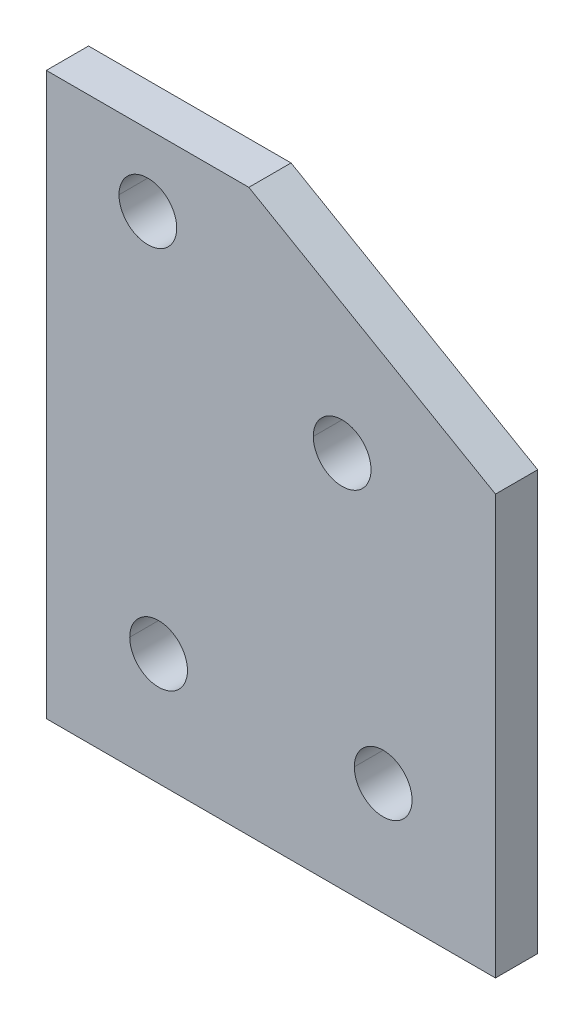
ISO-10303-21;
HEADER;
FILE_DESCRIPTION(('STEP AP214'),'2;1');
FILE_NAME('part.step','',(''),(''),'','','');
FILE_SCHEMA(('AUTOMOTIVE_DESIGN { 1 0 10303 214 1 1 1 1 }'));
ENDSEC;
DATA;
#1=APPLICATION_CONTEXT('core data for automotive mechanical design processes');
#2=APPLICATION_PROTOCOL_DEFINITION('international standard','automotive_design',2000,#1);
#3=PRODUCT_CONTEXT('',#1,'mechanical');
#4=PRODUCT('Part','Part','',(#3));
#5=PRODUCT_RELATED_PRODUCT_CATEGORY('part','',(#4));
#6=PRODUCT_DEFINITION_FORMATION('','',#4);
#7=PRODUCT_DEFINITION_CONTEXT('part definition',#1,'design');
#8=PRODUCT_DEFINITION('design','',#6,#7);
#9=PRODUCT_DEFINITION_SHAPE('','',#8);
#10=(LENGTH_UNIT() NAMED_UNIT(*) SI_UNIT(.MILLI.,.METRE.));
#11=(NAMED_UNIT(*) PLANE_ANGLE_UNIT() SI_UNIT($,.RADIAN.));
#12=(NAMED_UNIT(*) SI_UNIT($,.STERADIAN.) SOLID_ANGLE_UNIT());
#13=UNCERTAINTY_MEASURE_WITH_UNIT(LENGTH_MEASURE(1.E-05),#10,'distance_accuracy_value','');
#14=(GEOMETRIC_REPRESENTATION_CONTEXT(3) GLOBAL_UNCERTAINTY_ASSIGNED_CONTEXT((#13)) GLOBAL_UNIT_ASSIGNED_CONTEXT((#10,
#11,#12)) REPRESENTATION_CONTEXT('',''));
#15=CARTESIAN_POINT('',(0.,0.,0.));
#16=DIRECTION('',(0.,0.,1.));
#17=DIRECTION('',(1.,0.,0.));
#18=AXIS2_PLACEMENT_3D('',#15,#16,#17);
#19=CARTESIAN_POINT('',(-25.4,31.75,-2.3876));
#20=DIRECTION('',(0.,-1.,0.));
#21=DIRECTION('',(0.,0.,1.));
#22=AXIS2_PLACEMENT_3D('',#19,#20,#21);
#23=PLANE('',#22);
#24=DIRECTION('',(1.,0.,0.));
#25=VECTOR('',#24,1.);
#26=CARTESIAN_POINT('',(-25.4,31.75,2.3876));
#27=LINE('',#26,#25);
#28=CARTESIAN_POINT('',(-25.4,31.75,2.3876));
#29=VERTEX_POINT('',#28);
#30=CARTESIAN_POINT('',(-2.492248,31.75,2.3876));
#31=VERTEX_POINT('',#30);
#32=EDGE_CURVE('E11',#29,#31,#27,.T.);
#33=ORIENTED_EDGE('',*,*,#32,.T.);
#34=DIRECTION('',(0.,0.,1.));
#35=VECTOR('',#34,1.);
#36=CARTESIAN_POINT('',(-2.492248,31.75,-2.3876));
#37=LINE('',#36,#35);
#38=CARTESIAN_POINT('',(-2.492248,31.75,-2.3876));
#39=VERTEX_POINT('',#38);
#40=EDGE_CURVE('E24',#39,#31,#37,.T.);
#41=ORIENTED_EDGE('',*,*,#40,.F.);
#42=DIRECTION('',(1.,0.,0.));
#43=VECTOR('',#42,1.);
#44=CARTESIAN_POINT('',(-25.4,31.75,-2.3876));
#45=LINE('',#44,#43);
#46=CARTESIAN_POINT('',(-25.4,31.75,-2.3876));
#47=VERTEX_POINT('',#46);
#48=EDGE_CURVE('E308',#47,#39,#45,.T.);
#49=ORIENTED_EDGE('',*,*,#48,.F.);
#50=DIRECTION('',(0.,0.,1.));
#51=VECTOR('',#50,1.);
#52=CARTESIAN_POINT('',(-25.4,31.75,-2.3876));
#53=LINE('',#52,#51);
#54=EDGE_CURVE('E304',#47,#29,#53,.T.);
#55=ORIENTED_EDGE('',*,*,#54,.T.);
#56=EDGE_LOOP('',(#33,#41,#49,#55));
#57=FACE_BOUND('',#56,.T.);
#58=ADVANCED_FACE('F16',(#57),#23,.F.);
#59=CARTESIAN_POINT('',(-25.4,-31.75,-2.3876));
#60=DIRECTION('',(1.,0.,0.));
#61=DIRECTION('',(0.,0.,-1.));
#62=AXIS2_PLACEMENT_3D('',#59,#60,#61);
#63=PLANE('',#62);
#64=DIRECTION('',(0.,1.,0.));
#65=VECTOR('',#64,1.);
#66=CARTESIAN_POINT('',(-25.4,-31.75,2.3876));
#67=LINE('',#66,#65);
#68=CARTESIAN_POINT('',(-25.4,-31.75,2.3876));
#69=VERTEX_POINT('',#68);
#70=EDGE_CURVE('E299',#69,#29,#67,.T.);
#71=ORIENTED_EDGE('',*,*,#70,.T.);
#72=ORIENTED_EDGE('',*,*,#54,.F.);
#73=DIRECTION('',(0.,1.,0.));
#74=VECTOR('',#73,1.);
#75=CARTESIAN_POINT('',(-25.4,-31.75,-2.3876));
#76=LINE('',#75,#74);
#77=CARTESIAN_POINT('',(-25.4,-31.75,-2.3876));
#78=VERTEX_POINT('',#77);
#79=EDGE_CURVE('E294',#78,#47,#76,.T.);
#80=ORIENTED_EDGE('',*,*,#79,.F.);
#81=DIRECTION('',(0.,0.,1.));
#82=VECTOR('',#81,1.);
#83=CARTESIAN_POINT('',(-25.4,-31.75,-2.3876));
#84=LINE('',#83,#82);
#85=EDGE_CURVE('E290',#78,#69,#84,.T.);
#86=ORIENTED_EDGE('',*,*,#85,.T.);
#87=EDGE_LOOP('',(#71,#72,#80,#86));
#88=FACE_BOUND('',#87,.T.);
#89=ADVANCED_FACE('F332',(#88),#63,.F.);
#90=CARTESIAN_POINT('',(25.4,-31.75,-2.3876));
#91=DIRECTION('',(0.,1.,0.));
#92=DIRECTION('',(0.,0.,-1.));
#93=AXIS2_PLACEMENT_3D('',#90,#91,#92);
#94=PLANE('',#93);
#95=DIRECTION('',(-1.,0.,0.));
#96=VECTOR('',#95,1.);
#97=CARTESIAN_POINT('',(25.4,-31.75,2.3876));
#98=LINE('',#97,#96);
#99=CARTESIAN_POINT('',(25.4,-31.75,2.3876));
#100=VERTEX_POINT('',#99);
#101=EDGE_CURVE('E285',#100,#69,#98,.T.);
#102=ORIENTED_EDGE('',*,*,#101,.T.);
#103=ORIENTED_EDGE('',*,*,#85,.F.);
#104=DIRECTION('',(-1.,0.,0.));
#105=VECTOR('',#104,1.);
#106=CARTESIAN_POINT('',(25.4,-31.75,-2.3876));
#107=LINE('',#106,#105);
#108=CARTESIAN_POINT('',(25.4,-31.75,-2.3876));
#109=VERTEX_POINT('',#108);
#110=EDGE_CURVE('E280',#109,#78,#107,.T.);
#111=ORIENTED_EDGE('',*,*,#110,.F.);
#112=DIRECTION('',(0.,0.,1.));
#113=VECTOR('',#112,1.);
#114=CARTESIAN_POINT('',(25.4,-31.75,-2.3876));
#115=LINE('',#114,#113);
#116=EDGE_CURVE('E276',#109,#100,#115,.T.);
#117=ORIENTED_EDGE('',*,*,#116,.T.);
#118=EDGE_LOOP('',(#102,#103,#111,#117));
#119=FACE_BOUND('',#118,.T.);
#120=ADVANCED_FACE('F335',(#119),#94,.F.);
#121=CARTESIAN_POINT('',(25.4,15.6464,-2.3876));
#122=DIRECTION('',(-1.,0.,0.));
#123=DIRECTION('',(0.,0.,1.));
#124=AXIS2_PLACEMENT_3D('',#121,#122,#123);
#125=PLANE('',#124);
#126=DIRECTION('',(0.,-1.,0.));
#127=VECTOR('',#126,1.);
#128=CARTESIAN_POINT('',(25.4,15.6464,2.3876));
#129=LINE('',#128,#127);
#130=CARTESIAN_POINT('',(25.4,15.6464,2.3876));
#131=VERTEX_POINT('',#130);
#132=EDGE_CURVE('E271',#131,#100,#129,.T.);
#133=ORIENTED_EDGE('',*,*,#132,.T.);
#134=ORIENTED_EDGE('',*,*,#116,.F.);
#135=DIRECTION('',(0.,-1.,0.));
#136=VECTOR('',#135,1.);
#137=CARTESIAN_POINT('',(25.4,15.6464,-2.3876));
#138=LINE('',#137,#136);
#139=CARTESIAN_POINT('',(25.4,15.6464,-2.3876));
#140=VERTEX_POINT('',#139);
#141=EDGE_CURVE('E266',#140,#109,#138,.T.);
#142=ORIENTED_EDGE('',*,*,#141,.F.);
#143=DIRECTION('',(0.,0.,1.));
#144=VECTOR('',#143,1.);
#145=CARTESIAN_POINT('',(25.4,15.6464,-2.3876));
#146=LINE('',#145,#144);
#147=EDGE_CURVE('E262',#140,#131,#146,.T.);
#148=ORIENTED_EDGE('',*,*,#147,.T.);
#149=EDGE_LOOP('',(#133,#134,#142,#148));
#150=FACE_BOUND('',#149,.T.);
#151=ADVANCED_FACE('F327',(#150),#125,.F.);
#152=CARTESIAN_POINT('',(-2.492248,31.75,-2.3876));
#153=DIRECTION('',(-0.500000072396,-0.866025361986585,0.));
#154=DIRECTION('',(-0.866025361986585,0.500000072396,0.));
#155=AXIS2_PLACEMENT_3D('',#152,#153,#154);
#156=PLANE('',#155);
#157=DIRECTION('',(0.866025361986585,-0.500000072396,0.));
#158=VECTOR('',#157,1.);
#159=CARTESIAN_POINT('',(-2.492248,31.75,2.3876));
#160=LINE('',#159,#158);
#161=EDGE_CURVE('E257',#31,#131,#160,.T.);
#162=ORIENTED_EDGE('',*,*,#161,.T.);
#163=ORIENTED_EDGE('',*,*,#147,.F.);
#164=DIRECTION('',(0.866025361986585,-0.500000072396,0.));
#165=VECTOR('',#164,1.);
#166=CARTESIAN_POINT('',(-2.492248,31.75,-2.3876));
#167=LINE('',#166,#165);
#168=EDGE_CURVE('E252',#39,#140,#167,.T.);
#169=ORIENTED_EDGE('',*,*,#168,.F.);
#170=ORIENTED_EDGE('',*,*,#40,.T.);
#171=EDGE_LOOP('',(#162,#163,#169,#170));
#172=FACE_BOUND('',#171,.T.);
#173=ADVANCED_FACE('F319',(#172),#156,.F.);
#174=CARTESIAN_POINT('',(0.,-31.75,-2.3876));
#175=DIRECTION('',(0.,0.,-1.));
#176=DIRECTION('',(-1.,0.,0.));
#177=AXIS2_PLACEMENT_3D('',#174,#175,#176);
#178=PLANE('',#177);
#179=CARTESIAN_POINT('',(12.7,-19.05,-2.3876));
#180=DIRECTION('',(0.,0.,-1.));
#181=DIRECTION('',(-1.,0.,0.));
#182=AXIS2_PLACEMENT_3D('',#179,#180,#181);
#183=CIRCLE('',#182,3.2639);
#184=CARTESIAN_POINT('',(9.4361,-19.05,-2.3876));
#185=VERTEX_POINT('',#184);
#186=CARTESIAN_POINT('',(15.9639,-19.05,-2.3876));
#187=VERTEX_POINT('',#186);
#188=EDGE_CURVE('E247',#185,#187,#183,.T.);
#189=ORIENTED_EDGE('',*,*,#188,.F.);
#190=CARTESIAN_POINT('',(12.7,-19.05,-2.3876));
#191=DIRECTION('',(0.,0.,-1.));
#192=DIRECTION('',(-1.,0.,0.));
#193=AXIS2_PLACEMENT_3D('',#190,#191,#192);
#194=CIRCLE('',#193,3.2639);
#195=EDGE_CURVE('E242',#187,#185,#194,.T.);
#196=ORIENTED_EDGE('',*,*,#195,.F.);
#197=EDGE_LOOP('',(#189,#196));
#198=FACE_BOUND('',#197,.T.);
#199=CARTESIAN_POINT('',(8.05942,10.99312,-2.3876));
#200=DIRECTION('',(0.,0.,-1.));
#201=DIRECTION('',(-1.,0.,0.));
#202=AXIS2_PLACEMENT_3D('',#199,#200,#201);
#203=CIRCLE('',#202,3.2639);
#204=CARTESIAN_POINT('',(4.79552,10.99312,-2.3876));
#205=VERTEX_POINT('',#204);
#206=CARTESIAN_POINT('',(11.32332,10.99312,-2.3876));
#207=VERTEX_POINT('',#206);
#208=EDGE_CURVE('E237',#205,#207,#203,.T.);
#209=ORIENTED_EDGE('',*,*,#208,.F.);
#210=CARTESIAN_POINT('',(8.05942,10.99312,-2.3876));
#211=DIRECTION('',(0.,0.,-1.));
#212=DIRECTION('',(-1.,0.,0.));
#213=AXIS2_PLACEMENT_3D('',#210,#211,#212);
#214=CIRCLE('',#213,3.2639);
#215=EDGE_CURVE('E232',#207,#205,#214,.T.);
#216=ORIENTED_EDGE('',*,*,#215,.F.);
#217=EDGE_LOOP('',(#209,#216));
#218=FACE_BOUND('',#217,.T.);
#219=CARTESIAN_POINT('',(-12.7,-19.05,-2.3876));
#220=DIRECTION('',(0.,0.,-1.));
#221=DIRECTION('',(-1.,0.,0.));
#222=AXIS2_PLACEMENT_3D('',#219,#220,#221);
#223=CIRCLE('',#222,3.2639);
#224=CARTESIAN_POINT('',(-15.9639,-19.05,-2.3876));
#225=VERTEX_POINT('',#224);
#226=CARTESIAN_POINT('',(-9.4361,-19.05,-2.3876));
#227=VERTEX_POINT('',#226);
#228=EDGE_CURVE('E228',#225,#227,#223,.T.);
#229=ORIENTED_EDGE('',*,*,#228,.F.);
#230=CARTESIAN_POINT('',(-12.7,-19.05,-2.3876));
#231=DIRECTION('',(0.,0.,-1.));
#232=DIRECTION('',(-1.,0.,0.));
#233=AXIS2_PLACEMENT_3D('',#230,#231,#232);
#234=CIRCLE('',#233,3.2639);
#235=EDGE_CURVE('E121',#227,#225,#234,.T.);
#236=ORIENTED_EDGE('',*,*,#235,.F.);
#237=EDGE_LOOP('',(#229,#236));
#238=FACE_BOUND('',#237,.T.);
#239=CARTESIAN_POINT('',(-13.91412,23.6795492340491,-2.3876));
#240=DIRECTION('',(0.,0.,-1.));
#241=DIRECTION('',(-1.,0.,0.));
#242=AXIS2_PLACEMENT_3D('',#239,#240,#241);
#243=CIRCLE('',#242,3.2639);
#244=CARTESIAN_POINT('',(-17.17802,23.6795492340491,-2.3876));
#245=VERTEX_POINT('',#244);
#246=CARTESIAN_POINT('',(-10.65022,23.6795492340491,-2.3876));
#247=VERTEX_POINT('',#246);
#248=EDGE_CURVE('E221',#245,#247,#243,.T.);
#249=ORIENTED_EDGE('',*,*,#248,.F.);
#250=CARTESIAN_POINT('',(-13.91412,23.6795492340491,-2.3876));
#251=DIRECTION('',(0.,0.,-1.));
#252=DIRECTION('',(-1.,0.,0.));
#253=AXIS2_PLACEMENT_3D('',#250,#251,#252);
#254=CIRCLE('',#253,3.2639);
#255=EDGE_CURVE('E217',#247,#245,#254,.T.);
#256=ORIENTED_EDGE('',*,*,#255,.F.);
#257=EDGE_LOOP('',(#249,#256));
#258=FACE_BOUND('',#257,.T.);
#259=ORIENTED_EDGE('',*,*,#168,.T.);
#260=ORIENTED_EDGE('',*,*,#141,.T.);
#261=ORIENTED_EDGE('',*,*,#110,.T.);
#262=ORIENTED_EDGE('',*,*,#79,.T.);
#263=ORIENTED_EDGE('',*,*,#48,.T.);
#264=EDGE_LOOP('',(#259,#260,#261,#262,#263));
#265=FACE_BOUND('',#264,.T.);
#266=ADVANCED_FACE('F329',(#198,#218,#238,#258,#265),#178,.T.);
#267=CARTESIAN_POINT('',(-13.91412,23.6795492340491,-2.3876));
#268=DIRECTION('',(0.,0.,-1.));
#269=DIRECTION('',(0.,1.,0.));
#270=AXIS2_PLACEMENT_3D('',#267,#268,#269);
#271=CYLINDRICAL_SURFACE('',#270,3.2639);
#272=CARTESIAN_POINT('',(-13.91412,23.6795492340491,2.3876));
#273=DIRECTION('',(0.,0.,-1.));
#274=DIRECTION('',(-1.,0.,0.));
#275=AXIS2_PLACEMENT_3D('',#272,#273,#274);
#276=CIRCLE('',#275,3.2639);
#277=CARTESIAN_POINT('',(-10.65022,23.6795492340491,2.3876));
#278=VERTEX_POINT('',#277);
#279=CARTESIAN_POINT('',(-17.17802,23.6795492340491,2.3876));
#280=VERTEX_POINT('',#279);
#281=EDGE_CURVE('E214',#278,#280,#276,.T.);
#282=ORIENTED_EDGE('',*,*,#281,.F.);
#283=CARTESIAN_POINT('',(-10.65022,23.6795492340491,2.3876));
#284=DIRECTION('',(0.,0.,-1.));
#285=VECTOR('',#284,1.);
#286=LINE('',#283,#285);
#287=EDGE_CURVE('E191',#278,#247,#286,.T.);
#288=ORIENTED_EDGE('',*,*,#287,.T.);
#289=ORIENTED_EDGE('',*,*,#255,.T.);
#290=CARTESIAN_POINT('',(-17.17802,23.6795492340491,2.3876));
#291=DIRECTION('',(0.,0.,-1.));
#292=VECTOR('',#291,1.);
#293=LINE('',#290,#292);
#294=EDGE_CURVE('E204',#280,#245,#293,.T.);
#295=ORIENTED_EDGE('',*,*,#294,.F.);
#296=EDGE_LOOP('',(#282,#288,#289,#295));
#297=FACE_BOUND('',#296,.T.);
#298=ADVANCED_FACE('F169',(#297),#271,.F.);
#299=CARTESIAN_POINT('',(-13.91412,23.6795492340491,-2.3876));
#300=DIRECTION('',(0.,0.,-1.));
#301=DIRECTION('',(0.,-1.,0.));
#302=AXIS2_PLACEMENT_3D('',#299,#300,#301);
#303=CYLINDRICAL_SURFACE('',#302,3.2639);
#304=ORIENTED_EDGE('',*,*,#248,.T.);
#305=ORIENTED_EDGE('',*,*,#287,.F.);
#306=CARTESIAN_POINT('',(-13.91412,23.6795492340491,2.3876));
#307=DIRECTION('',(0.,0.,-1.));
#308=DIRECTION('',(-1.,0.,0.));
#309=AXIS2_PLACEMENT_3D('',#306,#307,#308);
#310=CIRCLE('',#309,3.2639);
#311=EDGE_CURVE('E150',#280,#278,#310,.T.);
#312=ORIENTED_EDGE('',*,*,#311,.F.);
#313=ORIENTED_EDGE('',*,*,#294,.T.);
#314=EDGE_LOOP('',(#304,#305,#312,#313));
#315=FACE_BOUND('',#314,.T.);
#316=ADVANCED_FACE('F159',(#315),#303,.F.);
#317=CARTESIAN_POINT('',(0.,-31.75,2.3876));
#318=DIRECTION('',(0.,0.,-1.));
#319=DIRECTION('',(-1.,0.,0.));
#320=AXIS2_PLACEMENT_3D('',#317,#318,#319);
#321=PLANE('',#320);
#322=CARTESIAN_POINT('',(12.7,-19.05,2.3876));
#323=DIRECTION('',(0.,0.,-1.));
#324=DIRECTION('',(-1.,0.,0.));
#325=AXIS2_PLACEMENT_3D('',#322,#323,#324);
#326=CIRCLE('',#325,3.2639);
#327=CARTESIAN_POINT('',(9.4361,-19.05,2.3876));
#328=VERTEX_POINT('',#327);
#329=CARTESIAN_POINT('',(15.9639,-19.05,2.3876));
#330=VERTEX_POINT('',#329);
#331=EDGE_CURVE('E146',#328,#330,#326,.T.);
#332=ORIENTED_EDGE('',*,*,#331,.T.);
#333=CARTESIAN_POINT('',(12.7,-19.05,2.3876));
#334=DIRECTION('',(0.,0.,-1.));
#335=DIRECTION('',(-1.,0.,0.));
#336=AXIS2_PLACEMENT_3D('',#333,#334,#335);
#337=CIRCLE('',#336,3.2639);
#338=EDGE_CURVE('E142',#330,#328,#337,.T.);
#339=ORIENTED_EDGE('',*,*,#338,.T.);
#340=EDGE_LOOP('',(#332,#339));
#341=FACE_BOUND('',#340,.T.);
#342=CARTESIAN_POINT('',(8.05942,10.99312,2.3876));
#343=DIRECTION('',(0.,0.,-1.));
#344=DIRECTION('',(-1.,0.,0.));
#345=AXIS2_PLACEMENT_3D('',#342,#343,#344);
#346=CIRCLE('',#345,3.2639);
#347=CARTESIAN_POINT('',(4.79552,10.99312,2.3876));
#348=VERTEX_POINT('',#347);
#349=CARTESIAN_POINT('',(11.32332,10.99312,2.3876));
#350=VERTEX_POINT('',#349);
#351=EDGE_CURVE('E132',#348,#350,#346,.T.);
#352=ORIENTED_EDGE('',*,*,#351,.T.);
#353=CARTESIAN_POINT('',(8.05942,10.99312,2.3876));
#354=DIRECTION('',(0.,0.,-1.));
#355=DIRECTION('',(-1.,0.,0.));
#356=AXIS2_PLACEMENT_3D('',#353,#354,#355);
#357=CIRCLE('',#356,3.2639);
#358=EDGE_CURVE('E130',#350,#348,#357,.T.);
#359=ORIENTED_EDGE('',*,*,#358,.T.);
#360=EDGE_LOOP('',(#352,#359));
#361=FACE_BOUND('',#360,.T.);
#362=CARTESIAN_POINT('',(-12.7,-19.05,2.3876));
#363=DIRECTION('',(0.,0.,-1.));
#364=DIRECTION('',(-1.,0.,0.));
#365=AXIS2_PLACEMENT_3D('',#362,#363,#364);
#366=CIRCLE('',#365,3.2639);
#367=CARTESIAN_POINT('',(-15.9639,-19.05,2.3876));
#368=VERTEX_POINT('',#367);
#369=CARTESIAN_POINT('',(-9.4361,-19.05,2.3876));
#370=VERTEX_POINT('',#369);
#371=EDGE_CURVE('E110',#368,#370,#366,.T.);
#372=ORIENTED_EDGE('',*,*,#371,.T.);
#373=CARTESIAN_POINT('',(-12.7,-19.05,2.3876));
#374=DIRECTION('',(0.,0.,-1.));
#375=DIRECTION('',(-1.,0.,0.));
#376=AXIS2_PLACEMENT_3D('',#373,#374,#375);
#377=CIRCLE('',#376,3.2639);
#378=EDGE_CURVE('E105',#370,#368,#377,.T.);
#379=ORIENTED_EDGE('',*,*,#378,.T.);
#380=EDGE_LOOP('',(#372,#379));
#381=FACE_BOUND('',#380,.T.);
#382=ORIENTED_EDGE('',*,*,#311,.T.);
#383=ORIENTED_EDGE('',*,*,#281,.T.);
#384=EDGE_LOOP('',(#382,#383));
#385=FACE_BOUND('',#384,.T.);
#386=ORIENTED_EDGE('',*,*,#161,.F.);
#387=ORIENTED_EDGE('',*,*,#32,.F.);
#388=ORIENTED_EDGE('',*,*,#70,.F.);
#389=ORIENTED_EDGE('',*,*,#101,.F.);
#390=ORIENTED_EDGE('',*,*,#132,.F.);
#391=EDGE_LOOP('',(#386,#387,#388,#389,#390));
#392=FACE_BOUND('',#391,.T.);
#393=ADVANCED_FACE('F107',(#341,#361,#381,#385,#392),#321,.F.);
#394=CARTESIAN_POINT('',(-12.7,-19.05,-2.3876));
#395=DIRECTION('',(0.,0.,-1.));
#396=DIRECTION('',(0.,1.,0.));
#397=AXIS2_PLACEMENT_3D('',#394,#395,#396);
#398=CYLINDRICAL_SURFACE('',#397,3.2639);
#399=ORIENTED_EDGE('',*,*,#378,.F.);
#400=CARTESIAN_POINT('',(-9.4361,-19.05,2.3876));
#401=DIRECTION('',(0.,0.,-1.));
#402=VECTOR('',#401,1.);
#403=LINE('',#400,#402);
#404=EDGE_CURVE('E114',#370,#227,#403,.T.);
#405=ORIENTED_EDGE('',*,*,#404,.T.);
#406=ORIENTED_EDGE('',*,*,#235,.T.);
#407=CARTESIAN_POINT('',(-15.9639,-19.05,2.3876));
#408=DIRECTION('',(0.,0.,-1.));
#409=VECTOR('',#408,1.);
#410=LINE('',#407,#409);
#411=EDGE_CURVE('E118',#368,#225,#410,.T.);
#412=ORIENTED_EDGE('',*,*,#411,.F.);
#413=EDGE_LOOP('',(#399,#405,#406,#412));
#414=FACE_BOUND('',#413,.T.);
#415=ADVANCED_FACE('F120',(#414),#398,.F.);
#416=CARTESIAN_POINT('',(-12.7,-19.05,-2.3876));
#417=DIRECTION('',(0.,0.,-1.));
#418=DIRECTION('',(0.,-1.,0.));
#419=AXIS2_PLACEMENT_3D('',#416,#417,#418);
#420=CYLINDRICAL_SURFACE('',#419,3.2639);
#421=ORIENTED_EDGE('',*,*,#228,.T.);
#422=ORIENTED_EDGE('',*,*,#404,.F.);
#423=ORIENTED_EDGE('',*,*,#371,.F.);
#424=ORIENTED_EDGE('',*,*,#411,.T.);
#425=EDGE_LOOP('',(#421,#422,#423,#424));
#426=FACE_BOUND('',#425,.T.);
#427=ADVANCED_FACE('F128',(#426),#420,.F.);
#428=CARTESIAN_POINT('',(8.05942,10.99312,-2.3876));
#429=DIRECTION('',(0.,0.,-1.));
#430=DIRECTION('',(0.,1.,0.));
#431=AXIS2_PLACEMENT_3D('',#428,#429,#430);
#432=CYLINDRICAL_SURFACE('',#431,3.2639);
#433=ORIENTED_EDGE('',*,*,#358,.F.);
#434=CARTESIAN_POINT('',(11.32332,10.99312,2.3876));
#435=DIRECTION('',(0.,0.,-1.));
#436=VECTOR('',#435,1.);
#437=LINE('',#434,#436);
#438=EDGE_CURVE('E125',#350,#207,#437,.T.);
#439=ORIENTED_EDGE('',*,*,#438,.T.);
#440=ORIENTED_EDGE('',*,*,#215,.T.);
#441=CARTESIAN_POINT('',(4.79552,10.99312,2.3876));
#442=DIRECTION('',(0.,0.,-1.));
#443=VECTOR('',#442,1.);
#444=LINE('',#441,#443);
#445=EDGE_CURVE('E704',#348,#205,#444,.T.);
#446=ORIENTED_EDGE('',*,*,#445,.F.);
#447=EDGE_LOOP('',(#433,#439,#440,#446));
#448=FACE_BOUND('',#447,.T.);
#449=ADVANCED_FACE('F439',(#448),#432,.F.);
#450=CARTESIAN_POINT('',(8.05942,10.99312,-2.3876));
#451=DIRECTION('',(0.,0.,-1.));
#452=DIRECTION('',(0.,-1.,0.));
#453=AXIS2_PLACEMENT_3D('',#450,#451,#452);
#454=CYLINDRICAL_SURFACE('',#453,3.2639);
#455=ORIENTED_EDGE('',*,*,#208,.T.);
#456=ORIENTED_EDGE('',*,*,#438,.F.);
#457=ORIENTED_EDGE('',*,*,#351,.F.);
#458=ORIENTED_EDGE('',*,*,#445,.T.);
#459=EDGE_LOOP('',(#455,#456,#457,#458));
#460=FACE_BOUND('',#459,.T.);
#461=ADVANCED_FACE('F450',(#460),#454,.F.);
#462=CARTESIAN_POINT('',(12.7,-19.05,-2.3876));
#463=DIRECTION('',(0.,0.,-1.));
#464=DIRECTION('',(0.,1.,0.));
#465=AXIS2_PLACEMENT_3D('',#462,#463,#464);
#466=CYLINDRICAL_SURFACE('',#465,3.2639);
#467=ORIENTED_EDGE('',*,*,#338,.F.);
#468=CARTESIAN_POINT('',(15.9639,-19.05,2.3876));
#469=DIRECTION('',(0.,0.,-1.));
#470=VECTOR('',#469,1.);
#471=LINE('',#468,#470);
#472=EDGE_CURVE('E702',#330,#187,#471,.T.);
#473=ORIENTED_EDGE('',*,*,#472,.T.);
#474=ORIENTED_EDGE('',*,*,#195,.T.);
#475=CARTESIAN_POINT('',(9.4361,-19.05,2.3876));
#476=DIRECTION('',(0.,0.,-1.));
#477=VECTOR('',#476,1.);
#478=LINE('',#475,#477);
#479=EDGE_CURVE('E698',#328,#185,#478,.T.);
#480=ORIENTED_EDGE('',*,*,#479,.F.);
#481=EDGE_LOOP('',(#467,#473,#474,#480));
#482=FACE_BOUND('',#481,.T.);
#483=ADVANCED_FACE('F462',(#482),#466,.F.);
#484=CARTESIAN_POINT('',(12.7,-19.05,-2.3876));
#485=DIRECTION('',(0.,0.,-1.));
#486=DIRECTION('',(0.,-1.,0.));
#487=AXIS2_PLACEMENT_3D('',#484,#485,#486);
#488=CYLINDRICAL_SURFACE('',#487,3.2639);
#489=ORIENTED_EDGE('',*,*,#188,.T.);
#490=ORIENTED_EDGE('',*,*,#472,.F.);
#491=ORIENTED_EDGE('',*,*,#331,.F.);
#492=ORIENTED_EDGE('',*,*,#479,.T.);
#493=EDGE_LOOP('',(#489,#490,#491,#492));
#494=FACE_BOUND('',#493,.T.);
#495=ADVANCED_FACE('F474',(#494),#488,.F.);
#496=CLOSED_SHELL('',(#58,#89,#120,#151,#173,#266,#298,#316,#393,#415,#427,#449,#461,#483,#495));
#497=MANIFOLD_SOLID_BREP('B1',#496);
#498=ADVANCED_BREP_SHAPE_REPRESENTATION('',(#18,#497),#14);
#499=SHAPE_DEFINITION_REPRESENTATION(#9,#498);
ENDSEC;
END-ISO-10303-21;
